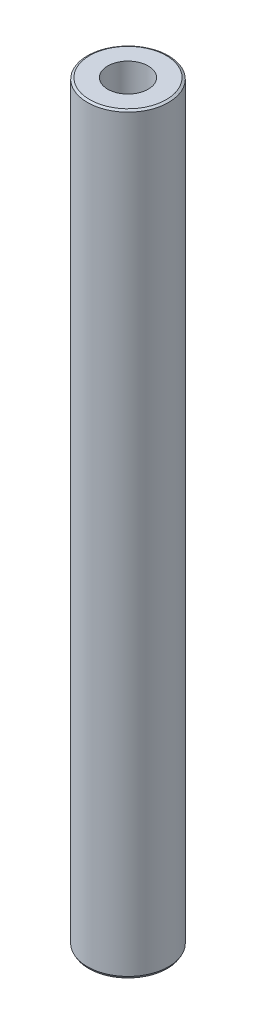
ISO-10303-21;
HEADER;
FILE_DESCRIPTION(('STEP AP214'),'2;1');
FILE_NAME('part.step','',(''),(''),'','','');
FILE_SCHEMA(('AUTOMOTIVE_DESIGN { 1 0 10303 214 1 1 1 1 }'));
ENDSEC;
DATA;
#1=APPLICATION_CONTEXT('core data for automotive mechanical design processes');
#2=APPLICATION_PROTOCOL_DEFINITION('international standard','automotive_design',2000,#1);
#3=PRODUCT_CONTEXT('',#1,'mechanical');
#4=PRODUCT('Part','Part','',(#3));
#5=PRODUCT_RELATED_PRODUCT_CATEGORY('part','',(#4));
#6=PRODUCT_DEFINITION_FORMATION('','',#4);
#7=PRODUCT_DEFINITION_CONTEXT('part definition',#1,'design');
#8=PRODUCT_DEFINITION('design','',#6,#7);
#9=PRODUCT_DEFINITION_SHAPE('','',#8);
#10=(LENGTH_UNIT() NAMED_UNIT(*) SI_UNIT(.MILLI.,.METRE.));
#11=(NAMED_UNIT(*) PLANE_ANGLE_UNIT() SI_UNIT($,.RADIAN.));
#12=(NAMED_UNIT(*) SI_UNIT($,.STERADIAN.) SOLID_ANGLE_UNIT());
#13=UNCERTAINTY_MEASURE_WITH_UNIT(LENGTH_MEASURE(1.E-05),#10,'distance_accuracy_value','');
#14=(GEOMETRIC_REPRESENTATION_CONTEXT(3) GLOBAL_UNCERTAINTY_ASSIGNED_CONTEXT((#13)) GLOBAL_UNIT_ASSIGNED_CONTEXT((#10,
#11,#12)) REPRESENTATION_CONTEXT('',''));
#15=CARTESIAN_POINT('',(0.,0.,0.));
#16=DIRECTION('',(0.,0.,1.));
#17=DIRECTION('',(1.,0.,0.));
#18=AXIS2_PLACEMENT_3D('',#15,#16,#17);
#19=CARTESIAN_POINT('',(0.,231.940165823046,0.));
#20=DIRECTION('',(0.,-1.,0.));
#21=DIRECTION('',(0.,0.,-1.));
#22=AXIS2_PLACEMENT_3D('',#19,#20,#21);
#23=CYLINDRICAL_SURFACE('',#22,12.5);
#24=CARTESIAN_POINT('',(0.,231.5343918189,0.));
#25=DIRECTION('',(0.,1.,0.));
#26=DIRECTION('',(0.,0.,1.));
#27=AXIS2_PLACEMENT_3D('',#24,#25,#26);
#28=CIRCLE('',#27,12.5);
#29=CARTESIAN_POINT('',(0.,231.5343918189,12.5));
#30=VERTEX_POINT('',#29);
#31=EDGE_CURVE('E50',#30,#30,#28,.F.);
#32=ORIENTED_EDGE('',*,*,#31,.T.);
#33=EDGE_LOOP('',(#32));
#34=FACE_BOUND('',#33,.T.);
#35=CARTESIAN_POINT('',(0.,0.702821191571612,0.));
#36=DIRECTION('',(0.,1.,0.));
#37=DIRECTION('',(0.,0.,1.));
#38=AXIS2_PLACEMENT_3D('',#35,#36,#37);
#39=CIRCLE('',#38,12.5);
#40=CARTESIAN_POINT('',(0.,0.702821191571612,12.5));
#41=VERTEX_POINT('',#40);
#42=EDGE_CURVE('E51',#41,#41,#39,.T.);
#43=ORIENTED_EDGE('',*,*,#42,.T.);
#44=EDGE_LOOP('',(#43));
#45=FACE_BOUND('',#44,.T.);
#46=ADVANCED_FACE('F39',(#34,#45),#23,.T.);
#47=CARTESIAN_POINT('',(0.,231.940165823046,0.));
#48=DIRECTION('',(0.,1.,0.));
#49=DIRECTION('',(0.,0.,1.));
#50=AXIS2_PLACEMENT_3D('',#47,#48,#49);
#51=PLANE('',#50);
#52=CARTESIAN_POINT('',(0.,231.940165823046,0.));
#53=DIRECTION('',(0.,1.,0.));
#54=DIRECTION('',(0.,0.,1.));
#55=AXIS2_PLACEMENT_3D('',#52,#53,#54);
#56=CIRCLE('',#55,11.7971788084284);
#57=CARTESIAN_POINT('',(0.,231.940165823046,11.7971788084284));
#58=VERTEX_POINT('',#57);
#59=EDGE_CURVE('E54',#58,#58,#56,.T.);
#60=ORIENTED_EDGE('',*,*,#59,.T.);
#61=EDGE_LOOP('',(#60));
#62=FACE_BOUND('',#61,.T.);
#63=CARTESIAN_POINT('',(0.,231.940165823046,0.));
#64=DIRECTION('',(0.,1.,0.));
#65=DIRECTION('',(0.,0.,1.));
#66=AXIS2_PLACEMENT_3D('',#63,#64,#65);
#67=CIRCLE('',#66,6.23869378110862);
#68=CARTESIAN_POINT('',(0.,231.940165823046,6.23869378110862));
#69=VERTEX_POINT('',#68);
#70=EDGE_CURVE('E58',#69,#69,#67,.T.);
#71=ORIENTED_EDGE('',*,*,#70,.F.);
#72=EDGE_LOOP('',(#71));
#73=FACE_BOUND('',#72,.T.);
#74=ADVANCED_FACE('F69',(#62,#73),#51,.T.);
#75=CARTESIAN_POINT('',(0.,0.,0.));
#76=DIRECTION('',(0.,1.,0.));
#77=DIRECTION('',(0.,0.,1.));
#78=AXIS2_PLACEMENT_3D('',#75,#76,#77);
#79=PLANE('',#78);
#80=CARTESIAN_POINT('',(0.,0.,0.));
#81=DIRECTION('',(0.,1.,0.));
#82=DIRECTION('',(0.,0.,1.));
#83=AXIS2_PLACEMENT_3D('',#80,#81,#82);
#84=CIRCLE('',#83,12.094225995854);
#85=CARTESIAN_POINT('',(0.,0.,12.094225995854));
#86=VERTEX_POINT('',#85);
#87=EDGE_CURVE('E10',#86,#86,#84,.F.);
#88=ORIENTED_EDGE('',*,*,#87,.T.);
#89=EDGE_LOOP('',(#88));
#90=FACE_BOUND('',#89,.T.);
#91=CARTESIAN_POINT('',(0.,0.,0.));
#92=DIRECTION('',(0.,1.,0.));
#93=DIRECTION('',(0.,0.,1.));
#94=AXIS2_PLACEMENT_3D('',#91,#92,#93);
#95=CIRCLE('',#94,6.23869378110862);
#96=CARTESIAN_POINT('',(0.,0.,6.23869378110862));
#97=VERTEX_POINT('',#96);
#98=EDGE_CURVE('E63',#97,#97,#95,.T.);
#99=ORIENTED_EDGE('',*,*,#98,.T.);
#100=EDGE_LOOP('',(#99));
#101=FACE_BOUND('',#100,.T.);
#102=ADVANCED_FACE('F75',(#90,#101),#79,.F.);
#103=CARTESIAN_POINT('',(0.,231.940165823046,0.));
#104=DIRECTION('',(0.,-1.,0.));
#105=DIRECTION('',(0.,0.,-1.));
#106=AXIS2_PLACEMENT_3D('',#103,#104,#105);
#107=CYLINDRICAL_SURFACE('',#106,6.23869378110862);
#108=ORIENTED_EDGE('',*,*,#70,.T.);
#109=EDGE_LOOP('',(#108));
#110=FACE_BOUND('',#109,.T.);
#111=ORIENTED_EDGE('',*,*,#98,.F.);
#112=EDGE_LOOP('',(#111));
#113=FACE_BOUND('',#112,.T.);
#114=ADVANCED_FACE('F70',(#110,#113),#107,.F.);
#115=CARTESIAN_POINT('',(0.,231.940165823046,0.));
#116=DIRECTION('',(0.,-1.,0.));
#117=DIRECTION('',(0.,0.,-1.));
#118=AXIS2_PLACEMENT_3D('',#115,#116,#117);
#119=CONICAL_SURFACE('',#118,11.7971788084284,1.04719755119658);
#120=ORIENTED_EDGE('',*,*,#31,.F.);
#121=EDGE_LOOP('',(#120));
#122=FACE_BOUND('',#121,.T.);
#123=ORIENTED_EDGE('',*,*,#59,.F.);
#124=EDGE_LOOP('',(#123));
#125=FACE_BOUND('',#124,.T.);
#126=ADVANCED_FACE('F81',(#122,#125),#119,.T.);
#127=CARTESIAN_POINT('',(0.,0.702821191571612,0.));
#128=DIRECTION('',(0.,1.,0.));
#129=DIRECTION('',(0.,0.,1.));
#130=AXIS2_PLACEMENT_3D('',#127,#128,#129);
#131=CONICAL_SURFACE('',#130,12.5,0.523598775598286);
#132=CARTESIAN_POINT('',(0.,0.,12.094225995854));
#133=CARTESIAN_POINT('',(0.,0.00732105407887102,12.0984528083972));
#134=CARTESIAN_POINT('',(0.,0.0146421081577419,12.1026796209403));
#135=CARTESIAN_POINT('',(0.,0.0292842163154836,12.1111332460267));
#136=CARTESIAN_POINT('',(0.,0.0366052703943545,12.1153600585699));
#137=CARTESIAN_POINT('',(0.,0.0512473785520965,12.1238136836563));
#138=CARTESIAN_POINT('',(0.,0.0585684326309677,12.1280404961995));
#139=CARTESIAN_POINT('',(0.,0.0732105407887096,12.1364941212858));
#140=CARTESIAN_POINT('',(0.,0.0805315948675805,12.140720933829));
#141=CARTESIAN_POINT('',(0.,0.0951737030253223,12.1491745589154));
#142=CARTESIAN_POINT('',(0.,0.102494757104193,12.1534013714586));
#143=CARTESIAN_POINT('',(0.,0.117136865261935,12.161854996545));
#144=CARTESIAN_POINT('',(0.,0.124457919340806,12.1660818090882));
#145=CARTESIAN_POINT('',(0.,0.139100027498548,12.1745354341745));
#146=CARTESIAN_POINT('',(0.,0.146421081577419,12.1787622467177));
#147=CARTESIAN_POINT('',(0.,0.161063189735161,12.1872158718041));
#148=CARTESIAN_POINT('',(0.,0.168384243814032,12.1914426843473));
#149=CARTESIAN_POINT('',(0.,0.183026351971774,12.1998963094337));
#150=CARTESIAN_POINT('',(0.,0.190347406050645,12.2041231219769));
#151=CARTESIAN_POINT('',(0.,0.204989514208387,12.2125767470632));
#152=CARTESIAN_POINT('',(0.,0.212310568287258,12.2168035596064));
#153=CARTESIAN_POINT('',(0.,0.226952676445,12.2252571846928));
#154=CARTESIAN_POINT('',(0.,0.234273730523871,12.229483997236));
#155=CARTESIAN_POINT('',(0.,0.248915838681613,12.2379376223224));
#156=CARTESIAN_POINT('',(0.,0.256236892760484,12.2421644348655));
#157=CARTESIAN_POINT('',(0.,0.270879000918225,12.2506180599519));
#158=CARTESIAN_POINT('',(0.,0.278200054997096,12.2548448724951));
#159=CARTESIAN_POINT('',(0.,0.292842163154838,12.2632984975815));
#160=CARTESIAN_POINT('',(0.,0.300163217233709,12.2675253101247));
#161=CARTESIAN_POINT('',(0.,0.314805325391451,12.275978935211));
#162=CARTESIAN_POINT('',(0.,0.322126379470322,12.2802057477542));
#163=CARTESIAN_POINT('',(0.,0.336768487628064,12.2886593728406));
#164=CARTESIAN_POINT('',(0.,0.344089541706935,12.2928861853838));
#165=CARTESIAN_POINT('',(0.,0.358731649864677,12.3013398104702));
#166=CARTESIAN_POINT('',(0.,0.366052703943548,12.3055666230134));
#167=CARTESIAN_POINT('',(0.,0.38069481210129,12.3140202480997));
#168=CARTESIAN_POINT('',(0.,0.388015866180161,12.3182470606429));
#169=CARTESIAN_POINT('',(0.,0.402657974337903,12.3267006857293));
#170=CARTESIAN_POINT('',(0.,0.409979028416774,12.3309274982725));
#171=CARTESIAN_POINT('',(0.,0.424621136574516,12.3393811233589));
#172=CARTESIAN_POINT('',(0.,0.431942190653387,12.343607935902));
#173=CARTESIAN_POINT('',(0.,0.446584298811128,12.3520615609884));
#174=CARTESIAN_POINT('',(0.,0.453905352889999,12.3562883735316));
#175=CARTESIAN_POINT('',(0.,0.468547461047741,12.364741998618));
#176=CARTESIAN_POINT('',(0.,0.475868515126612,12.3689688111612));
#177=CARTESIAN_POINT('',(0.,0.490510623284354,12.3774224362476));
#178=CARTESIAN_POINT('',(0.,0.497831677363225,12.3816492487907));
#179=CARTESIAN_POINT('',(0.,0.512473785520967,12.3901028738771));
#180=CARTESIAN_POINT('',(0.,0.519794839599838,12.3943296864203));
#181=CARTESIAN_POINT('',(0.,0.53443694775758,12.4027833115067));
#182=CARTESIAN_POINT('',(0.,0.541758001836451,12.4070101240499));
#183=CARTESIAN_POINT('',(0.,0.556400109994193,12.4154637491362));
#184=CARTESIAN_POINT('',(0.,0.563721164073064,12.4196905616794));
#185=CARTESIAN_POINT('',(0.,0.578363272230806,12.4281441867658));
#186=CARTESIAN_POINT('',(0.,0.585684326309677,12.432370999309));
#187=CARTESIAN_POINT('',(0.,0.600326434467419,12.4408246243954));
#188=CARTESIAN_POINT('',(0.,0.60764748854629,12.4450514369386));
#189=CARTESIAN_POINT('',(0.,0.622289596704032,12.4535050620249));
#190=CARTESIAN_POINT('',(0.,0.629610650782902,12.4577318745681));
#191=CARTESIAN_POINT('',(0.,0.644252758940644,12.4661854996545));
#192=CARTESIAN_POINT('',(0.,0.651573813019515,12.4704123121977));
#193=CARTESIAN_POINT('',(0.,0.666215921177257,12.4788659372841));
#194=CARTESIAN_POINT('',(0.,0.673536975256128,12.4830927498272));
#195=CARTESIAN_POINT('',(0.,0.68817908341387,12.4915463749136));
#196=CARTESIAN_POINT('',(0.,0.695500137492741,12.4957731874568));
#197=CARTESIAN_POINT('',(0.,0.702821191571612,12.5));
#198=B_SPLINE_CURVE_WITH_KNOTS('',3,(#132,#133,#134,#135,#136,#137,#138,#139,#140,#141,#142,
#143,#144,#145,#146,#147,#148,#149,#150,#151,#152,#153,#154,#155,#156,#157,#158,#159,#160,#161,
#162,#163,#164,#165,#166,#167,#168,#169,#170,#171,#172,#173,#174,#175,#176,#177,#178,#179,#180,
#181,#182,#183,#184,#185,#186,#187,#188,#189,#190,#191,#192,#193,#194,#195,#196,#197),
.UNSPECIFIED.,.F.,.F.,(4,2,2,2,2,2,2,2,2,2,2,2,2,2,2,2,2,2,2,2,2,2,2,2,2,2,2,2,2,2,2,2,4),(0.,
0.0253608752591277,0.0507217505182554,0.0760826257773823,0.10144350103651,0.126804376295638,
0.152165251554765,0.177526126813893,0.20288700207302,0.228247877332148,0.253608752591275,
0.278969627850403,0.304330503109531,0.329691378368659,0.355052253627785,0.380413128886913,
0.405774004146041,0.431134879405168,0.456495754664296,0.481856629923423,0.507217505182551,
0.532578380441678,0.557939255700806,0.583300130959934,0.608661006219062,0.634021881478188,
0.659382756737316,0.684743631996444,0.710104507255572,0.7354653825147,0.760826257773826,
0.786187133032954,0.811548008292082),.UNSPECIFIED.);
#199=EDGE_CURVE('BSEAM45',#86,#41,#198,.T.);
#200=ORIENTED_EDGE('',*,*,#87,.F.);
#201=ORIENTED_EDGE('',*,*,#42,.F.);
#202=ORIENTED_EDGE('',*,*,#199,.T.);
#203=ORIENTED_EDGE('',*,*,#199,.F.);
#204=EDGE_LOOP('',(#200,#202,#201,#203));
#205=FACE_BOUND('',#204,.T.);
#206=ADVANCED_FACE('F45',(#205),#131,.T.);
#207=CLOSED_SHELL('',(#46,#74,#102,#114,#126,#206));
#208=MANIFOLD_SOLID_BREP('B2',#207);
#209=ADVANCED_BREP_SHAPE_REPRESENTATION('',(#18,#208),#14);
#210=SHAPE_DEFINITION_REPRESENTATION(#9,#209);
ENDSEC;
END-ISO-10303-21;
